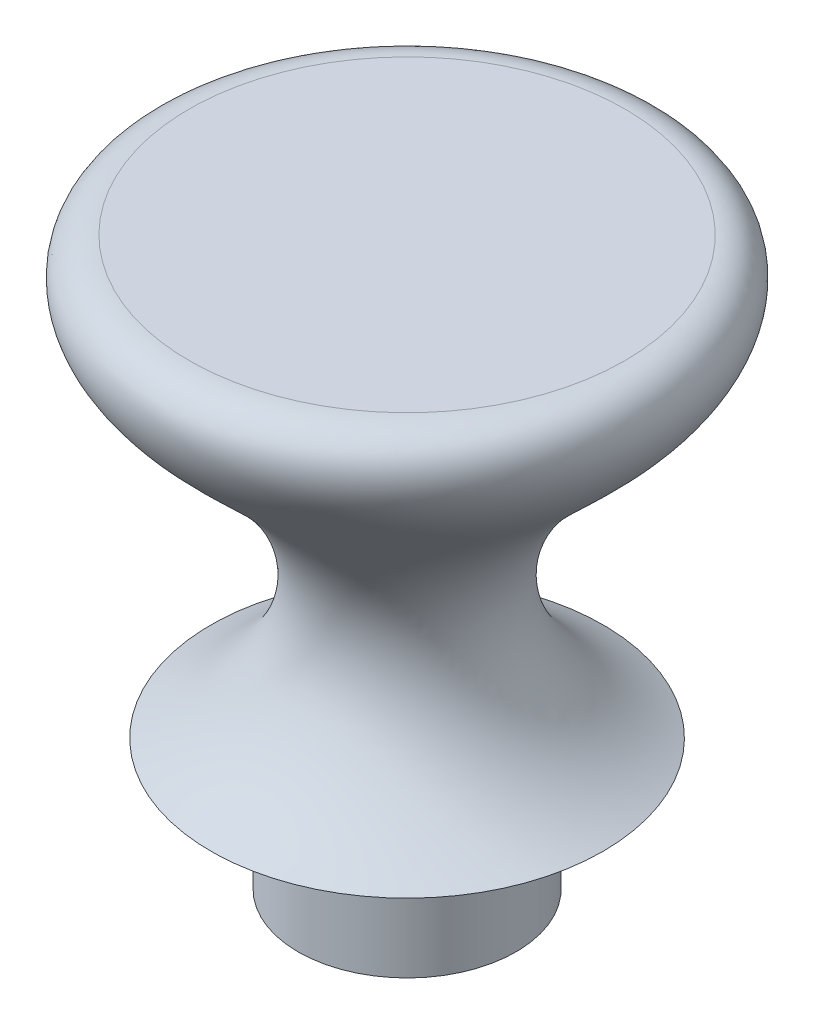
ISO-10303-21;
HEADER;
FILE_DESCRIPTION(('STEP AP214'),'2;1');
FILE_NAME('part.step','',(''),(''),'','','');
FILE_SCHEMA(('AUTOMOTIVE_DESIGN { 1 0 10303 214 1 1 1 1 }'));
ENDSEC;
DATA;
#1=APPLICATION_CONTEXT('core data for automotive mechanical design processes');
#2=APPLICATION_PROTOCOL_DEFINITION('international standard','automotive_design',2000,#1);
#3=PRODUCT_CONTEXT('',#1,'mechanical');
#4=PRODUCT('Part','Part','',(#3));
#5=PRODUCT_RELATED_PRODUCT_CATEGORY('part','',(#4));
#6=PRODUCT_DEFINITION_FORMATION('','',#4);
#7=PRODUCT_DEFINITION_CONTEXT('part definition',#1,'design');
#8=PRODUCT_DEFINITION('design','',#6,#7);
#9=PRODUCT_DEFINITION_SHAPE('','',#8);
#10=(LENGTH_UNIT() NAMED_UNIT(*) SI_UNIT(.MILLI.,.METRE.));
#11=(NAMED_UNIT(*) PLANE_ANGLE_UNIT() SI_UNIT($,.RADIAN.));
#12=(NAMED_UNIT(*) SI_UNIT($,.STERADIAN.) SOLID_ANGLE_UNIT());
#13=UNCERTAINTY_MEASURE_WITH_UNIT(LENGTH_MEASURE(1.E-05),#10,'distance_accuracy_value','');
#14=(GEOMETRIC_REPRESENTATION_CONTEXT(3) GLOBAL_UNCERTAINTY_ASSIGNED_CONTEXT((#13)) GLOBAL_UNIT_ASSIGNED_CONTEXT((#10,
#11,#12)) REPRESENTATION_CONTEXT('',''));
#15=CARTESIAN_POINT('',(0.,0.,0.));
#16=DIRECTION('',(0.,0.,1.));
#17=DIRECTION('',(1.,0.,0.));
#18=AXIS2_PLACEMENT_3D('',#15,#16,#17);
#19=CARTESIAN_POINT('',(0.,0.,0.));
#20=DIRECTION('',(0.,1.,0.));
#21=DIRECTION('',(-1.,0.,0.));
#22=AXIS2_PLACEMENT_3D('',#19,#20,#21);
#23=PLANE('',#22);
#24=CARTESIAN_POINT('',(0.,0.,0.));
#25=DIRECTION('',(0.,1.,0.));
#26=DIRECTION('',(0.,0.,1.));
#27=AXIS2_PLACEMENT_3D('',#24,#25,#26);
#28=CIRCLE('',#27,2.5);
#29=CARTESIAN_POINT('',(0.,0.,2.5));
#30=VERTEX_POINT('',#29);
#31=EDGE_CURVE('E45',#30,#30,#28,.T.);
#32=ORIENTED_EDGE('',*,*,#31,.T.);
#33=EDGE_LOOP('',(#32));
#34=FACE_BOUND('',#33,.T.);
#35=CARTESIAN_POINT('',(0.,0.,0.));
#36=DIRECTION('',(0.,-1.,0.));
#37=DIRECTION('',(1.,0.,0.));
#38=AXIS2_PLACEMENT_3D('',#35,#36,#37);
#39=CIRCLE('',#38,4.5);
#40=CARTESIAN_POINT('',(4.5,0.,0.));
#41=VERTEX_POINT('',#40);
#42=EDGE_CURVE('E10',#41,#41,#39,.T.);
#43=ORIENTED_EDGE('',*,*,#42,.T.);
#44=EDGE_LOOP('',(#43));
#45=FACE_BOUND('',#44,.T.);
#46=ADVANCED_FACE('F31',(#34,#45),#23,.F.);
#47=CARTESIAN_POINT('',(-5.,10.,0.));
#48=CARTESIAN_POINT('',(-6.57632207403824,10.,0.));
#49=CARTESIAN_POINT('',(-6.46519784658977,7.42904564508232,0.));
#50=CARTESIAN_POINT('',(-4.19508862871383,6.55592671513003,0.));
#51=CARTESIAN_POINT('',(-0.988360922343626,5.90505624007469,0.));
#52=CARTESIAN_POINT('',(-0.623238460727215,1.87283427265869,0.));
#53=CARTESIAN_POINT('',(-4.5,0.,0.));
#54=B_SPLINE_CURVE_WITH_KNOTS('',6,(#47,#48,#49,#50,#51,#52,#53),.UNSPECIFIED.,.F.,.F.,(7,7),
(0.,1.),.UNSPECIFIED.);
#55=CARTESIAN_POINT('',(3.4666284598732E-13,-99.2881852555407,0.));
#56=DIRECTION('',(0.,-1.,0.));
#57=AXIS1_PLACEMENT('',#55,#56);
#58=SURFACE_OF_REVOLUTION('',#54,#57);
#59=ORIENTED_EDGE('',*,*,#42,.F.);
#60=EDGE_LOOP('',(#59));
#61=FACE_BOUND('',#60,.T.);
#62=CARTESIAN_POINT('',(0.,10.,0.));
#63=DIRECTION('',(0.,-1.,0.));
#64=DIRECTION('',(1.,0.,0.));
#65=AXIS2_PLACEMENT_3D('',#62,#63,#64);
#66=CIRCLE('',#65,4.99999999999997);
#67=CARTESIAN_POINT('',(4.99999999999993,10.,0.));
#68=VERTEX_POINT('',#67);
#69=EDGE_CURVE('E37',#68,#68,#66,.T.);
#70=ORIENTED_EDGE('',*,*,#69,.T.);
#71=EDGE_LOOP('',(#70));
#72=FACE_BOUND('',#71,.T.);
#73=ADVANCED_FACE('F55',(#61,#72),#58,.T.);
#74=CARTESIAN_POINT('',(0.,10.,0.));
#75=DIRECTION('',(0.,-1.,0.));
#76=DIRECTION('',(1.,0.,0.));
#77=AXIS2_PLACEMENT_3D('',#74,#75,#76);
#78=PLANE('',#77);
#79=ORIENTED_EDGE('',*,*,#69,.F.);
#80=EDGE_LOOP('',(#79));
#81=FACE_BOUND('',#80,.T.);
#82=ADVANCED_FACE('F58',(#81),#78,.F.);
#83=CARTESIAN_POINT('',(0.,-3.,0.));
#84=DIRECTION('',(0.,1.,0.));
#85=DIRECTION('',(0.,0.,1.));
#86=AXIS2_PLACEMENT_3D('',#83,#84,#85);
#87=CYLINDRICAL_SURFACE('',#86,2.5);
#88=CARTESIAN_POINT('',(0.,-3.,0.));
#89=DIRECTION('',(0.,1.,0.));
#90=DIRECTION('',(0.,0.,1.));
#91=AXIS2_PLACEMENT_3D('',#88,#89,#90);
#92=CIRCLE('',#91,2.5);
#93=CARTESIAN_POINT('',(0.,-3.,2.5));
#94=VERTEX_POINT('',#93);
#95=EDGE_CURVE('E41',#94,#94,#92,.T.);
#96=ORIENTED_EDGE('',*,*,#95,.T.);
#97=EDGE_LOOP('',(#96));
#98=FACE_BOUND('',#97,.T.);
#99=ORIENTED_EDGE('',*,*,#31,.F.);
#100=EDGE_LOOP('',(#99));
#101=FACE_BOUND('',#100,.T.);
#102=ADVANCED_FACE('F62',(#98,#101),#87,.T.);
#103=CARTESIAN_POINT('',(0.,-3.,0.));
#104=DIRECTION('',(0.,1.,0.));
#105=DIRECTION('',(0.,0.,1.));
#106=AXIS2_PLACEMENT_3D('',#103,#104,#105);
#107=PLANE('',#106);
#108=ORIENTED_EDGE('',*,*,#95,.F.);
#109=EDGE_LOOP('',(#108));
#110=FACE_BOUND('',#109,.T.);
#111=ADVANCED_FACE('F66',(#110),#107,.F.);
#112=CLOSED_SHELL('',(#46,#73,#82,#102,#111));
#113=MANIFOLD_SOLID_BREP('B2',#112);
#114=ADVANCED_BREP_SHAPE_REPRESENTATION('',(#18,#113),#14);
#115=SHAPE_DEFINITION_REPRESENTATION(#9,#114);
ENDSEC;
END-ISO-10303-21;
